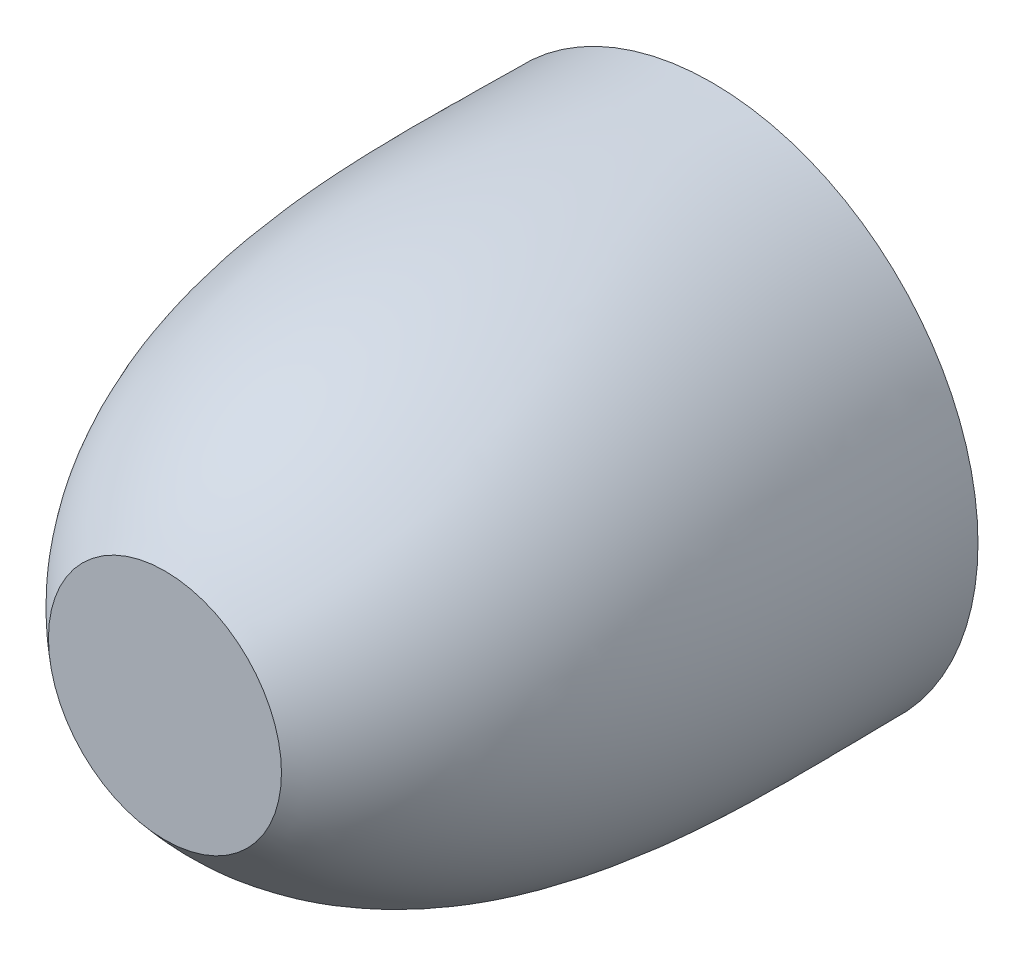
ISO-10303-21;
HEADER;
FILE_DESCRIPTION(('STEP AP214'),'2;1');
FILE_NAME('part.step','',(''),(''),'','','');
FILE_SCHEMA(('AUTOMOTIVE_DESIGN { 1 0 10303 214 1 1 1 1 }'));
ENDSEC;
DATA;
#1=APPLICATION_CONTEXT('core data for automotive mechanical design processes');
#2=APPLICATION_PROTOCOL_DEFINITION('international standard','automotive_design',2000,#1);
#3=PRODUCT_CONTEXT('',#1,'mechanical');
#4=PRODUCT('Part','Part','',(#3));
#5=PRODUCT_RELATED_PRODUCT_CATEGORY('part','',(#4));
#6=PRODUCT_DEFINITION_FORMATION('','',#4);
#7=PRODUCT_DEFINITION_CONTEXT('part definition',#1,'design');
#8=PRODUCT_DEFINITION('design','',#6,#7);
#9=PRODUCT_DEFINITION_SHAPE('','',#8);
#10=(LENGTH_UNIT() NAMED_UNIT(*) SI_UNIT(.MILLI.,.METRE.));
#11=(NAMED_UNIT(*) PLANE_ANGLE_UNIT() SI_UNIT($,.RADIAN.));
#12=(NAMED_UNIT(*) SI_UNIT($,.STERADIAN.) SOLID_ANGLE_UNIT());
#13=UNCERTAINTY_MEASURE_WITH_UNIT(LENGTH_MEASURE(1.E-05),#10,'distance_accuracy_value','');
#14=(GEOMETRIC_REPRESENTATION_CONTEXT(3) GLOBAL_UNCERTAINTY_ASSIGNED_CONTEXT((#13)) GLOBAL_UNIT_ASSIGNED_CONTEXT((#10,
#11,#12)) REPRESENTATION_CONTEXT('',''));
#15=CARTESIAN_POINT('',(0.,0.,0.));
#16=DIRECTION('',(0.,0.,1.));
#17=DIRECTION('',(1.,0.,0.));
#18=AXIS2_PLACEMENT_3D('',#15,#16,#17);
#19=CARTESIAN_POINT('',(-1.61803398875047,1.17557050458536,-43.));
#20=DIRECTION('',(0.809016994374947,-0.587785252292473,0.));
#21=DIRECTION('',(0.587785252292473,0.809016994374947,0.));
#22=AXIS2_PLACEMENT_3D('',#19,#20,#21);
#23=PLANE('',#22);
#24=DIRECTION('',(-0.587785252292473,-0.809016994374947,0.));
#25=VECTOR('',#24,1.);
#26=CARTESIAN_POINT('',(-1.61803398875047,1.17557050458536,-45.));
#27=LINE('',#26,#25);
#28=CARTESIAN_POINT('',(-4.31160439975929,-2.53181111064333,-45.));
#29=VERTEX_POINT('',#28);
#30=CARTESIAN_POINT('',(-14.6433140663486,-16.7521895032941,-45.));
#31=VERTEX_POINT('',#30);
#32=EDGE_CURVE('E257',#29,#31,#27,.T.);
#33=ORIENTED_EDGE('',*,*,#32,.T.);
#34=DIRECTION('',(0.,0.,-1.));
#35=VECTOR('',#34,1.);
#36=CARTESIAN_POINT('',(-14.6433140663486,-16.7521895032941,-43.));
#37=LINE('',#36,#35);
#38=CARTESIAN_POINT('',(-14.6433140663486,-16.7521895032941,-43.));
#39=VERTEX_POINT('',#38);
#40=EDGE_CURVE('E12',#39,#31,#37,.T.);
#41=ORIENTED_EDGE('',*,*,#40,.F.);
#42=DIRECTION('',(-0.587785252292473,-0.809016994374947,0.));
#43=VECTOR('',#42,1.);
#44=CARTESIAN_POINT('',(-1.61803398875047,1.17557050458536,-43.));
#45=LINE('',#44,#43);
#46=CARTESIAN_POINT('',(-4.31160439975929,-2.53181111064333,-43.));
#47=VERTEX_POINT('',#46);
#48=EDGE_CURVE('E220',#47,#39,#45,.T.);
#49=ORIENTED_EDGE('',*,*,#48,.F.);
#50=DIRECTION('',(0.,0.,-1.));
#51=VECTOR('',#50,1.);
#52=CARTESIAN_POINT('',(-4.31160439975929,-2.53181111064333,-43.));
#53=LINE('',#52,#51);
#54=EDGE_CURVE('E48',#47,#29,#53,.T.);
#55=ORIENTED_EDGE('',*,*,#54,.T.);
#56=EDGE_LOOP('',(#33,#41,#49,#55));
#57=FACE_BOUND('',#56,.T.);
#58=ADVANCED_FACE('F45',(#57),#23,.F.);
#59=CARTESIAN_POINT('',(0.,0.,-43.));
#60=DIRECTION('',(0.,0.,-1.));
#61=DIRECTION('',(-1.,0.,0.));
#62=AXIS2_PLACEMENT_3D('',#59,#60,#61);
#63=CYLINDRICAL_SURFACE('',#62,22.25);
#64=CARTESIAN_POINT('',(0.,0.,-45.));
#65=DIRECTION('',(0.,0.,-1.));
#66=DIRECTION('',(-1.,0.,0.));
#67=AXIS2_PLACEMENT_3D('',#64,#65,#66);
#68=CIRCLE('',#67,22.25);
#69=CARTESIAN_POINT('',(-11.4072460888489,-19.1033305124641,-45.));
#70=VERTEX_POINT('',#69);
#71=EDGE_CURVE('E132',#31,#70,#68,.F.);
#72=ORIENTED_EDGE('',*,*,#71,.T.);
#73=DIRECTION('',(0.,0.,-1.));
#74=VECTOR('',#73,1.);
#75=CARTESIAN_POINT('',(-11.4072460888489,-19.1033305124641,-43.));
#76=LINE('',#75,#74);
#77=CARTESIAN_POINT('',(-11.4072460888489,-19.1033305124641,-43.));
#78=VERTEX_POINT('',#77);
#79=EDGE_CURVE('E54',#78,#70,#76,.T.);
#80=ORIENTED_EDGE('',*,*,#79,.F.);
#81=CARTESIAN_POINT('',(0.,0.,-43.));
#82=DIRECTION('',(0.,0.,-1.));
#83=DIRECTION('',(-1.,0.,0.));
#84=AXIS2_PLACEMENT_3D('',#81,#82,#83);
#85=CIRCLE('',#84,22.25);
#86=EDGE_CURVE('E62',#39,#78,#85,.F.);
#87=ORIENTED_EDGE('',*,*,#86,.F.);
#88=ORIENTED_EDGE('',*,*,#40,.T.);
#89=EDGE_LOOP('',(#72,#80,#87,#88));
#90=FACE_BOUND('',#89,.T.);
#91=ADVANCED_FACE('F366',(#90),#63,.T.);
#92=CARTESIAN_POINT('',(1.61803398874932,-1.17557050458453,-43.));
#93=DIRECTION('',(0.809016994374947,-0.587785252292473,0.));
#94=DIRECTION('',(0.587785252292473,0.809016994374947,0.));
#95=AXIS2_PLACEMENT_3D('',#92,#93,#94);
#96=PLANE('',#95);
#97=DIRECTION('',(-0.587785252292473,-0.809016994374947,0.));
#98=VECTOR('',#97,1.);
#99=CARTESIAN_POINT('',(1.61803398874932,-1.17557050458453,-45.));
#100=LINE('',#99,#98);
#101=CARTESIAN_POINT('',(-1.07553642225961,-4.88295211981347,-45.));
#102=VERTEX_POINT('',#101);
#103=EDGE_CURVE('E192',#102,#70,#100,.T.);
#104=ORIENTED_EDGE('',*,*,#103,.F.);
#105=DIRECTION('',(0.,0.,-1.));
#106=VECTOR('',#105,1.);
#107=CARTESIAN_POINT('',(-1.07553642225961,-4.88295211981347,-43.));
#108=LINE('',#107,#106);
#109=CARTESIAN_POINT('',(-1.07553642225961,-4.88295211981347,-43.));
#110=VERTEX_POINT('',#109);
#111=EDGE_CURVE('E188',#110,#102,#108,.T.);
#112=ORIENTED_EDGE('',*,*,#111,.F.);
#113=DIRECTION('',(-0.587785252292473,-0.809016994374947,0.));
#114=VECTOR('',#113,1.);
#115=CARTESIAN_POINT('',(1.61803398874932,-1.17557050458453,-43.));
#116=LINE('',#115,#114);
#117=EDGE_CURVE('E191',#110,#78,#116,.T.);
#118=ORIENTED_EDGE('',*,*,#117,.T.);
#119=ORIENTED_EDGE('',*,*,#79,.T.);
#120=EDGE_LOOP('',(#104,#112,#118,#119));
#121=FACE_BOUND('',#120,.T.);
#122=ADVANCED_FACE('F190',(#121),#96,.T.);
#123=CARTESIAN_POINT('',(0.,0.,-43.));
#124=DIRECTION('',(0.,0.,-1.));
#125=DIRECTION('',(-1.,0.,0.));
#126=AXIS2_PLACEMENT_3D('',#123,#124,#125);
#127=CYLINDRICAL_SURFACE('',#126,5.);
#128=CARTESIAN_POINT('',(0.,0.,-45.));
#129=DIRECTION('',(0.,0.,-1.));
#130=DIRECTION('',(-1.,0.,0.));
#131=AXIS2_PLACEMENT_3D('',#128,#129,#130);
#132=CIRCLE('',#131,5.);
#133=CARTESIAN_POINT('',(1.0755364222584,-4.8829521198138,-45.));
#134=VERTEX_POINT('',#133);
#135=EDGE_CURVE('E264',#134,#102,#132,.T.);
#136=ORIENTED_EDGE('',*,*,#135,.F.);
#137=DIRECTION('',(0.,0.,-1.));
#138=VECTOR('',#137,1.);
#139=CARTESIAN_POINT('',(1.0755364222584,-4.8829521198138,-43.));
#140=LINE('',#139,#138);
#141=CARTESIAN_POINT('',(1.0755364222584,-4.8829521198138,-43.));
#142=VERTEX_POINT('',#141);
#143=EDGE_CURVE('E197',#142,#134,#140,.T.);
#144=ORIENTED_EDGE('',*,*,#143,.F.);
#145=CARTESIAN_POINT('',(0.,0.,-43.));
#146=DIRECTION('',(0.,0.,-1.));
#147=DIRECTION('',(-1.,0.,0.));
#148=AXIS2_PLACEMENT_3D('',#145,#146,#147);
#149=CIRCLE('',#148,5.);
#150=EDGE_CURVE('E203',#142,#110,#149,.T.);
#151=ORIENTED_EDGE('',*,*,#150,.T.);
#152=ORIENTED_EDGE('',*,*,#111,.T.);
#153=EDGE_LOOP('',(#136,#144,#151,#152));
#154=FACE_BOUND('',#153,.T.);
#155=ADVANCED_FACE('F205',(#154),#127,.T.);
#156=CARTESIAN_POINT('',(-1.61803398875028,-1.17557050458523,-43.));
#157=DIRECTION('',(0.809016994374948,0.587785252292473,0.));
#158=DIRECTION('',(-0.587785252292473,0.809016994374948,0.));
#159=AXIS2_PLACEMENT_3D('',#156,#157,#158);
#160=PLANE('',#159);
#161=DIRECTION('',(0.587785252292473,-0.809016994374948,0.));
#162=VECTOR('',#161,1.);
#163=CARTESIAN_POINT('',(-1.61803398875028,-1.17557050458523,-45.));
#164=LINE('',#163,#162);
#165=CARTESIAN_POINT('',(11.4072460888479,-19.1033305124647,-45.));
#166=VERTEX_POINT('',#165);
#167=EDGE_CURVE('E297',#134,#166,#164,.T.);
#168=ORIENTED_EDGE('',*,*,#167,.T.);
#169=DIRECTION('',(0.,0.,-1.));
#170=VECTOR('',#169,1.);
#171=CARTESIAN_POINT('',(11.4072460888479,-19.1033305124647,-43.));
#172=LINE('',#171,#170);
#173=CARTESIAN_POINT('',(11.4072460888479,-19.1033305124647,-43.));
#174=VERTEX_POINT('',#173);
#175=EDGE_CURVE('E305',#174,#166,#172,.T.);
#176=ORIENTED_EDGE('',*,*,#175,.F.);
#177=DIRECTION('',(0.587785252292473,-0.809016994374948,0.));
#178=VECTOR('',#177,1.);
#179=CARTESIAN_POINT('',(-1.61803398875028,-1.17557050458523,-43.));
#180=LINE('',#179,#178);
#181=EDGE_CURVE('E207',#142,#174,#180,.T.);
#182=ORIENTED_EDGE('',*,*,#181,.F.);
#183=ORIENTED_EDGE('',*,*,#143,.T.);
#184=EDGE_LOOP('',(#168,#176,#182,#183));
#185=FACE_BOUND('',#184,.T.);
#186=ADVANCED_FACE('F363',(#185),#160,.F.);
#187=CARTESIAN_POINT('',(0.,0.,-43.));
#188=DIRECTION('',(0.,0.,-1.));
#189=DIRECTION('',(-1.,0.,0.));
#190=AXIS2_PLACEMENT_3D('',#187,#188,#189);
#191=CYLINDRICAL_SURFACE('',#190,22.25);
#192=CARTESIAN_POINT('',(0.,0.,-45.));
#193=DIRECTION('',(0.,0.,-1.));
#194=DIRECTION('',(-1.,0.,0.));
#195=AXIS2_PLACEMENT_3D('',#192,#193,#194);
#196=CIRCLE('',#195,22.25);
#197=CARTESIAN_POINT('',(14.6433140663477,-16.7521895032949,-45.));
#198=VERTEX_POINT('',#197);
#199=EDGE_CURVE('E294',#166,#198,#196,.F.);
#200=ORIENTED_EDGE('',*,*,#199,.T.);
#201=DIRECTION('',(0.,0.,-1.));
#202=VECTOR('',#201,1.);
#203=CARTESIAN_POINT('',(14.6433140663477,-16.7521895032949,-43.));
#204=LINE('',#203,#202);
#205=CARTESIAN_POINT('',(14.6433140663477,-16.7521895032949,-43.));
#206=VERTEX_POINT('',#205);
#207=EDGE_CURVE('E308',#206,#198,#204,.T.);
#208=ORIENTED_EDGE('',*,*,#207,.F.);
#209=CARTESIAN_POINT('',(0.,0.,-43.));
#210=DIRECTION('',(0.,0.,-1.));
#211=DIRECTION('',(-1.,0.,0.));
#212=AXIS2_PLACEMENT_3D('',#209,#210,#211);
#213=CIRCLE('',#212,22.25);
#214=EDGE_CURVE('E211',#174,#206,#213,.F.);
#215=ORIENTED_EDGE('',*,*,#214,.F.);
#216=ORIENTED_EDGE('',*,*,#175,.T.);
#217=EDGE_LOOP('',(#200,#208,#215,#216));
#218=FACE_BOUND('',#217,.T.);
#219=ADVANCED_FACE('F544',(#218),#191,.T.);
#220=CARTESIAN_POINT('',(1.6180339887495,1.17557050458466,-43.));
#221=DIRECTION('',(0.809016994374948,0.587785252292473,0.));
#222=DIRECTION('',(-0.587785252292473,0.809016994374948,0.));
#223=AXIS2_PLACEMENT_3D('',#220,#221,#222);
#224=PLANE('',#223);
#225=DIRECTION('',(0.587785252292473,-0.809016994374948,0.));
#226=VECTOR('',#225,1.);
#227=CARTESIAN_POINT('',(1.6180339887495,1.17557050458466,-45.));
#228=LINE('',#227,#226);
#229=CARTESIAN_POINT('',(4.31160439975846,-2.53181111064393,-45.));
#230=VERTEX_POINT('',#229);
#231=EDGE_CURVE('E291',#230,#198,#228,.T.);
#232=ORIENTED_EDGE('',*,*,#231,.F.);
#233=DIRECTION('',(0.,0.,-1.));
#234=VECTOR('',#233,1.);
#235=CARTESIAN_POINT('',(4.31160439975846,-2.53181111064393,-43.));
#236=LINE('',#235,#234);
#237=CARTESIAN_POINT('',(4.31160439975846,-2.53181111064393,-43.));
#238=VERTEX_POINT('',#237);
#239=EDGE_CURVE('E310',#238,#230,#236,.T.);
#240=ORIENTED_EDGE('',*,*,#239,.F.);
#241=DIRECTION('',(0.587785252292473,-0.809016994374948,0.));
#242=VECTOR('',#241,1.);
#243=CARTESIAN_POINT('',(1.6180339887495,1.17557050458466,-43.));
#244=LINE('',#243,#242);
#245=EDGE_CURVE('E216',#238,#206,#244,.T.);
#246=ORIENTED_EDGE('',*,*,#245,.T.);
#247=ORIENTED_EDGE('',*,*,#207,.T.);
#248=EDGE_LOOP('',(#232,#240,#246,#247));
#249=FACE_BOUND('',#248,.T.);
#250=ADVANCED_FACE('F535',(#249),#224,.T.);
#251=CARTESIAN_POINT('',(4.97632246485322,-0.486019264839568,-45.));
#252=VERTEX_POINT('',#251);
#253=EDGE_CURVE('E290',#252,#230,#132,.T.);
#254=ORIENTED_EDGE('',*,*,#253,.F.);
#255=DIRECTION('',(0.,0.,-1.));
#256=VECTOR('',#255,1.);
#257=CARTESIAN_POINT('',(4.97632246485322,-0.486019264839568,-43.));
#258=LINE('',#257,#256);
#259=CARTESIAN_POINT('',(4.97632246485322,-0.486019264839568,-43.));
#260=VERTEX_POINT('',#259);
#261=EDGE_CURVE('E312',#260,#252,#258,.T.);
#262=ORIENTED_EDGE('',*,*,#261,.F.);
#263=EDGE_CURVE('E209',#260,#238,#149,.T.);
#264=ORIENTED_EDGE('',*,*,#263,.T.);
#265=ORIENTED_EDGE('',*,*,#239,.T.);
#266=EDGE_LOOP('',(#254,#262,#264,#265));
#267=FACE_BOUND('',#266,.T.);
#268=ADVANCED_FACE('F364',(#267),#127,.T.);
#269=CARTESIAN_POINT('',(0.618033988749908,-1.90211303259035,-43.));
#270=DIRECTION('',(-0.309016994374947,0.951056516295154,0.));
#271=DIRECTION('',(-0.951056516295154,-0.309016994374947,0.));
#272=AXIS2_PLACEMENT_3D('',#269,#270,#271);
#273=PLANE('',#272);
#274=DIRECTION('',(0.951056516295154,0.309016994374947,0.));
#275=VECTOR('',#274,1.);
#276=CARTESIAN_POINT('',(0.618033988749908,-1.90211303259035,-45.));
#277=LINE('',#276,#275);
#278=CARTESIAN_POINT('',(21.6933798672906,4.94568194826853,-45.));
#279=VERTEX_POINT('',#278);
#280=EDGE_CURVE('E288',#252,#279,#277,.T.);
#281=ORIENTED_EDGE('',*,*,#280,.T.);
#282=DIRECTION('',(0.,0.,-1.));
#283=VECTOR('',#282,1.);
#284=CARTESIAN_POINT('',(21.6933798672906,4.94568194826853,-43.));
#285=LINE('',#284,#283);
#286=CARTESIAN_POINT('',(21.6933798672906,4.94568194826853,-43.));
#287=VERTEX_POINT('',#286);
#288=EDGE_CURVE('E314',#287,#279,#285,.T.);
#289=ORIENTED_EDGE('',*,*,#288,.F.);
#290=DIRECTION('',(0.951056516295154,0.309016994374947,0.));
#291=VECTOR('',#290,1.);
#292=CARTESIAN_POINT('',(0.618033988749908,-1.90211303259035,-43.));
#293=LINE('',#292,#291);
#294=EDGE_CURVE('E217',#260,#287,#293,.T.);
#295=ORIENTED_EDGE('',*,*,#294,.F.);
#296=ORIENTED_EDGE('',*,*,#261,.T.);
#297=EDGE_LOOP('',(#281,#289,#295,#296));
#298=FACE_BOUND('',#297,.T.);
#299=ADVANCED_FACE('F515',(#298),#273,.F.);
#300=CARTESIAN_POINT('',(0.,0.,-43.));
#301=DIRECTION('',(0.,0.,-1.));
#302=DIRECTION('',(-1.,0.,0.));
#303=AXIS2_PLACEMENT_3D('',#300,#301,#302);
#304=CYLINDRICAL_SURFACE('',#303,22.25);
#305=CARTESIAN_POINT('',(0.,0.,-45.));
#306=DIRECTION('',(0.,0.,-1.));
#307=DIRECTION('',(-1.,0.,0.));
#308=AXIS2_PLACEMENT_3D('',#305,#306,#307);
#309=CIRCLE('',#308,22.25);
#310=CARTESIAN_POINT('',(20.4573118897909,8.74990801344915,-45.));
#311=VERTEX_POINT('',#310);
#312=EDGE_CURVE('E285',#279,#311,#309,.F.);
#313=ORIENTED_EDGE('',*,*,#312,.T.);
#314=DIRECTION('',(0.,0.,-1.));
#315=VECTOR('',#314,1.);
#316=CARTESIAN_POINT('',(20.4573118897909,8.74990801344915,-43.));
#317=LINE('',#316,#315);
#318=CARTESIAN_POINT('',(20.4573118897909,8.74990801344915,-43.));
#319=VERTEX_POINT('',#318);
#320=EDGE_CURVE('E317',#319,#311,#317,.T.);
#321=ORIENTED_EDGE('',*,*,#320,.F.);
#322=CARTESIAN_POINT('',(0.,0.,-43.));
#323=DIRECTION('',(0.,0.,-1.));
#324=DIRECTION('',(-1.,0.,0.));
#325=AXIS2_PLACEMENT_3D('',#322,#323,#324);
#326=CIRCLE('',#325,22.25);
#327=EDGE_CURVE('E241',#287,#319,#326,.F.);
#328=ORIENTED_EDGE('',*,*,#327,.F.);
#329=ORIENTED_EDGE('',*,*,#288,.T.);
#330=EDGE_LOOP('',(#313,#321,#328,#329));
#331=FACE_BOUND('',#330,.T.);
#332=ADVANCED_FACE('F505',(#331),#304,.T.);
#333=CARTESIAN_POINT('',(-0.618033988749881,1.90211303259027,-43.));
#334=DIRECTION('',(-0.309016994374947,0.951056516295154,0.));
#335=DIRECTION('',(-0.951056516295154,-0.309016994374947,0.));
#336=AXIS2_PLACEMENT_3D('',#333,#334,#335);
#337=PLANE('',#336);
#338=DIRECTION('',(0.951056516295154,0.309016994374947,0.));
#339=VECTOR('',#338,1.);
#340=CARTESIAN_POINT('',(-0.618033988749881,1.90211303259027,-45.));
#341=LINE('',#340,#339);
#342=CARTESIAN_POINT('',(3.7402544873534,3.31820680034121,-45.));
#343=VERTEX_POINT('',#342);
#344=EDGE_CURVE('E282',#343,#311,#341,.T.);
#345=ORIENTED_EDGE('',*,*,#344,.F.);
#346=DIRECTION('',(0.,0.,-1.));
#347=VECTOR('',#346,1.);
#348=CARTESIAN_POINT('',(3.7402544873534,3.31820680034121,-43.));
#349=LINE('',#348,#347);
#350=CARTESIAN_POINT('',(3.7402544873534,3.31820680034121,-43.));
#351=VERTEX_POINT('',#350);
#352=EDGE_CURVE('E319',#351,#343,#349,.T.);
#353=ORIENTED_EDGE('',*,*,#352,.F.);
#354=DIRECTION('',(0.951056516295154,0.309016994374947,0.));
#355=VECTOR('',#354,1.);
#356=CARTESIAN_POINT('',(-0.618033988749881,1.90211303259027,-43.));
#357=LINE('',#356,#355);
#358=EDGE_CURVE('E236',#351,#319,#357,.T.);
#359=ORIENTED_EDGE('',*,*,#358,.T.);
#360=ORIENTED_EDGE('',*,*,#320,.T.);
#361=EDGE_LOOP('',(#345,#353,#359,#360));
#362=FACE_BOUND('',#361,.T.);
#363=ADVANCED_FACE('F497',(#362),#337,.T.);
#364=CARTESIAN_POINT('',(2.,4.58257569495584,-45.));
#365=VERTEX_POINT('',#364);
#366=EDGE_CURVE('E281',#365,#343,#132,.T.);
#367=ORIENTED_EDGE('',*,*,#366,.F.);
#368=DIRECTION('',(0.,0.,-1.));
#369=VECTOR('',#368,1.);
#370=CARTESIAN_POINT('',(2.,4.58257569495584,-43.));
#371=LINE('',#370,#369);
#372=CARTESIAN_POINT('',(2.,4.58257569495584,-43.));
#373=VERTEX_POINT('',#372);
#374=EDGE_CURVE('E321',#373,#365,#371,.T.);
#375=ORIENTED_EDGE('',*,*,#374,.F.);
#376=EDGE_CURVE('E218',#373,#351,#149,.T.);
#377=ORIENTED_EDGE('',*,*,#376,.T.);
#378=ORIENTED_EDGE('',*,*,#352,.T.);
#379=EDGE_LOOP('',(#367,#375,#377,#378));
#380=FACE_BOUND('',#379,.T.);
#381=ADVANCED_FACE('F361',(#380),#127,.T.);
#382=CARTESIAN_POINT('',(2.,0.,-43.));
#383=DIRECTION('',(-1.,0.,0.));
#384=DIRECTION('',(0.,0.,1.));
#385=AXIS2_PLACEMENT_3D('',#382,#383,#384);
#386=PLANE('',#385);
#387=DIRECTION('',(0.,1.,0.));
#388=VECTOR('',#387,1.);
#389=CARTESIAN_POINT('',(2.,0.,-45.));
#390=LINE('',#389,#388);
#391=CARTESIAN_POINT('',(2.,22.1599300540412,-45.));
#392=VERTEX_POINT('',#391);
#393=EDGE_CURVE('E279',#365,#392,#390,.T.);
#394=ORIENTED_EDGE('',*,*,#393,.T.);
#395=DIRECTION('',(0.,0.,-1.));
#396=VECTOR('',#395,1.);
#397=CARTESIAN_POINT('',(2.,22.1599300540412,-43.));
#398=LINE('',#397,#396);
#399=CARTESIAN_POINT('',(2.,22.1599300540412,-43.));
#400=VERTEX_POINT('',#399);
#401=EDGE_CURVE('E323',#400,#392,#398,.T.);
#402=ORIENTED_EDGE('',*,*,#401,.F.);
#403=DIRECTION('',(0.,1.,0.));
#404=VECTOR('',#403,1.);
#405=CARTESIAN_POINT('',(2.,0.,-43.));
#406=LINE('',#405,#404);
#407=EDGE_CURVE('E237',#373,#400,#406,.T.);
#408=ORIENTED_EDGE('',*,*,#407,.F.);
#409=ORIENTED_EDGE('',*,*,#374,.T.);
#410=EDGE_LOOP('',(#394,#402,#408,#409));
#411=FACE_BOUND('',#410,.T.);
#412=ADVANCED_FACE('F477',(#411),#386,.F.);
#413=CARTESIAN_POINT('',(0.,0.,-43.));
#414=DIRECTION('',(0.,0.,-1.));
#415=DIRECTION('',(-1.,0.,0.));
#416=AXIS2_PLACEMENT_3D('',#413,#414,#415);
#417=CYLINDRICAL_SURFACE('',#416,22.25);
#418=CARTESIAN_POINT('',(0.,0.,-45.));
#419=DIRECTION('',(0.,0.,-1.));
#420=DIRECTION('',(-1.,0.,0.));
#421=AXIS2_PLACEMENT_3D('',#418,#419,#420);
#422=CIRCLE('',#421,22.25);
#423=CARTESIAN_POINT('',(-2.,22.1599300540412,-45.));
#424=VERTEX_POINT('',#423);
#425=EDGE_CURVE('E276',#392,#424,#422,.F.);
#426=ORIENTED_EDGE('',*,*,#425,.T.);
#427=DIRECTION('',(0.,0.,-1.));
#428=VECTOR('',#427,1.);
#429=CARTESIAN_POINT('',(-2.,22.1599300540412,-43.));
#430=LINE('',#429,#428);
#431=CARTESIAN_POINT('',(-2.,22.1599300540412,-43.));
#432=VERTEX_POINT('',#431);
#433=EDGE_CURVE('E326',#432,#424,#430,.T.);
#434=ORIENTED_EDGE('',*,*,#433,.F.);
#435=CARTESIAN_POINT('',(0.,0.,-43.));
#436=DIRECTION('',(0.,0.,-1.));
#437=DIRECTION('',(-1.,0.,0.));
#438=AXIS2_PLACEMENT_3D('',#435,#436,#437);
#439=CIRCLE('',#438,22.25);
#440=EDGE_CURVE('E232',#400,#432,#439,.F.);
#441=ORIENTED_EDGE('',*,*,#440,.F.);
#442=ORIENTED_EDGE('',*,*,#401,.T.);
#443=EDGE_LOOP('',(#426,#434,#441,#442));
#444=FACE_BOUND('',#443,.T.);
#445=ADVANCED_FACE('F467',(#444),#417,.T.);
#446=CARTESIAN_POINT('',(-2.,0.,-43.));
#447=DIRECTION('',(-1.,0.,0.));
#448=DIRECTION('',(0.,0.,1.));
#449=AXIS2_PLACEMENT_3D('',#446,#447,#448);
#450=PLANE('',#449);
#451=DIRECTION('',(0.,1.,0.));
#452=VECTOR('',#451,1.);
#453=CARTESIAN_POINT('',(-2.,0.,-45.));
#454=LINE('',#453,#452);
#455=CARTESIAN_POINT('',(-2.,4.58257569495584,-45.));
#456=VERTEX_POINT('',#455);
#457=EDGE_CURVE('E273',#456,#424,#454,.T.);
#458=ORIENTED_EDGE('',*,*,#457,.F.);
#459=DIRECTION('',(0.,0.,-1.));
#460=VECTOR('',#459,1.);
#461=CARTESIAN_POINT('',(-2.,4.58257569495584,-43.));
#462=LINE('',#461,#460);
#463=CARTESIAN_POINT('',(-2.,4.58257569495584,-43.));
#464=VERTEX_POINT('',#463);
#465=EDGE_CURVE('E328',#464,#456,#462,.T.);
#466=ORIENTED_EDGE('',*,*,#465,.F.);
#467=DIRECTION('',(0.,1.,0.));
#468=VECTOR('',#467,1.);
#469=CARTESIAN_POINT('',(-2.,0.,-43.));
#470=LINE('',#469,#468);
#471=EDGE_CURVE('E227',#464,#432,#470,.T.);
#472=ORIENTED_EDGE('',*,*,#471,.T.);
#473=ORIENTED_EDGE('',*,*,#433,.T.);
#474=EDGE_LOOP('',(#458,#466,#472,#473));
#475=FACE_BOUND('',#474,.T.);
#476=ADVANCED_FACE('F360',(#475),#450,.T.);
#477=CARTESIAN_POINT('',(-3.74025448735357,3.31820680034159,-45.));
#478=VERTEX_POINT('',#477);
#479=EDGE_CURVE('E265',#478,#456,#132,.T.);
#480=ORIENTED_EDGE('',*,*,#479,.F.);
#481=DIRECTION('',(0.,0.,-1.));
#482=VECTOR('',#481,1.);
#483=CARTESIAN_POINT('',(-3.74025448735357,3.31820680034159,-43.));
#484=LINE('',#483,#482);
#485=CARTESIAN_POINT('',(-3.74025448735357,3.31820680034159,-43.));
#486=VERTEX_POINT('',#485);
#487=EDGE_CURVE('E330',#486,#478,#484,.T.);
#488=ORIENTED_EDGE('',*,*,#487,.F.);
#489=EDGE_CURVE('E221',#486,#464,#149,.T.);
#490=ORIENTED_EDGE('',*,*,#489,.T.);
#491=ORIENTED_EDGE('',*,*,#465,.T.);
#492=EDGE_LOOP('',(#480,#488,#490,#491));
#493=FACE_BOUND('',#492,.T.);
#494=ADVANCED_FACE('F347',(#493),#127,.T.);
#495=CARTESIAN_POINT('',(0.618033988750022,1.9021130325907,-43.));
#496=DIRECTION('',(-0.309016994374948,-0.951056516295154,0.));
#497=DIRECTION('',(0.951056516295154,-0.309016994374948,0.));
#498=AXIS2_PLACEMENT_3D('',#495,#496,#497);
#499=PLANE('',#498);
#500=DIRECTION('',(-0.951056516295154,0.309016994374948,0.));
#501=VECTOR('',#500,1.);
#502=CARTESIAN_POINT('',(0.618033988750022,1.9021130325907,-45.));
#503=LINE('',#502,#501);
#504=CARTESIAN_POINT('',(-20.4573118897907,8.74990801344958,-45.));
#505=VERTEX_POINT('',#504);
#506=EDGE_CURVE('E271',#478,#505,#503,.T.);
#507=ORIENTED_EDGE('',*,*,#506,.T.);
#508=DIRECTION('',(0.,0.,-1.));
#509=VECTOR('',#508,1.);
#510=CARTESIAN_POINT('',(-20.4573118897907,8.74990801344958,-43.));
#511=LINE('',#510,#509);
#512=CARTESIAN_POINT('',(-20.4573118897907,8.74990801344958,-43.));
#513=VERTEX_POINT('',#512);
#514=EDGE_CURVE('E332',#513,#505,#511,.T.);
#515=ORIENTED_EDGE('',*,*,#514,.F.);
#516=DIRECTION('',(-0.951056516295154,0.309016994374948,0.));
#517=VECTOR('',#516,1.);
#518=CARTESIAN_POINT('',(0.618033988750022,1.9021130325907,-43.));
#519=LINE('',#518,#517);
#520=EDGE_CURVE('E228',#486,#513,#519,.T.);
#521=ORIENTED_EDGE('',*,*,#520,.F.);
#522=ORIENTED_EDGE('',*,*,#487,.T.);
#523=EDGE_LOOP('',(#507,#515,#521,#522));
#524=FACE_BOUND('',#523,.T.);
#525=ADVANCED_FACE('F359',(#524),#499,.F.);
#526=CARTESIAN_POINT('',(0.,0.,-43.));
#527=DIRECTION('',(0.,0.,-1.));
#528=DIRECTION('',(-1.,0.,0.));
#529=AXIS2_PLACEMENT_3D('',#526,#527,#528);
#530=CYLINDRICAL_SURFACE('',#529,22.25);
#531=CARTESIAN_POINT('',(0.,0.,-45.));
#532=DIRECTION('',(0.,0.,-1.));
#533=DIRECTION('',(-1.,0.,0.));
#534=AXIS2_PLACEMENT_3D('',#531,#532,#533);
#535=CIRCLE('',#534,22.25);
#536=CARTESIAN_POINT('',(-21.6933798672905,4.94568194826899,-45.));
#537=VERTEX_POINT('',#536);
#538=EDGE_CURVE('E268',#505,#537,#535,.F.);
#539=ORIENTED_EDGE('',*,*,#538,.T.);
#540=DIRECTION('',(0.,0.,-1.));
#541=VECTOR('',#540,1.);
#542=CARTESIAN_POINT('',(-21.6933798672905,4.94568194826899,-43.));
#543=LINE('',#542,#541);
#544=CARTESIAN_POINT('',(-21.6933798672905,4.94568194826899,-43.));
#545=VERTEX_POINT('',#544);
#546=EDGE_CURVE('E335',#545,#537,#543,.T.);
#547=ORIENTED_EDGE('',*,*,#546,.F.);
#548=CARTESIAN_POINT('',(0.,0.,-43.));
#549=DIRECTION('',(0.,0.,-1.));
#550=DIRECTION('',(-1.,0.,0.));
#551=AXIS2_PLACEMENT_3D('',#548,#549,#550);
#552=CIRCLE('',#551,22.25);
#553=EDGE_CURVE('E224',#513,#545,#552,.F.);
#554=ORIENTED_EDGE('',*,*,#553,.F.);
#555=ORIENTED_EDGE('',*,*,#514,.T.);
#556=EDGE_LOOP('',(#539,#547,#554,#555));
#557=FACE_BOUND('',#556,.T.);
#558=ADVANCED_FACE('F354',(#557),#530,.T.);
#559=CARTESIAN_POINT('',(-0.618033988749768,-1.90211303258992,-43.));
#560=DIRECTION('',(-0.309016994374948,-0.951056516295154,0.));
#561=DIRECTION('',(0.951056516295154,-0.309016994374948,0.));
#562=AXIS2_PLACEMENT_3D('',#559,#560,#561);
#563=PLANE('',#562);
#564=DIRECTION('',(-0.951056516295154,0.309016994374948,0.));
#565=VECTOR('',#564,1.);
#566=CARTESIAN_POINT('',(-0.618033988749768,-1.90211303258992,-45.));
#567=LINE('',#566,#565);
#568=CARTESIAN_POINT('',(-4.97632246485348,-0.48601926483892,-45.));
#569=VERTEX_POINT('',#568);
#570=EDGE_CURVE('E263',#569,#537,#567,.T.);
#571=ORIENTED_EDGE('',*,*,#570,.F.);
#572=DIRECTION('',(0.,0.,-1.));
#573=VECTOR('',#572,1.);
#574=CARTESIAN_POINT('',(-4.97632246485348,-0.48601926483892,-43.));
#575=LINE('',#574,#573);
#576=CARTESIAN_POINT('',(-4.97632246485348,-0.48601926483892,-43.));
#577=VERTEX_POINT('',#576);
#578=EDGE_CURVE('E336',#577,#569,#575,.T.);
#579=ORIENTED_EDGE('',*,*,#578,.F.);
#580=DIRECTION('',(-0.951056516295154,0.309016994374948,0.));
#581=VECTOR('',#580,1.);
#582=CARTESIAN_POINT('',(-0.618033988749768,-1.90211303258992,-43.));
#583=LINE('',#582,#581);
#584=EDGE_CURVE('E219',#577,#545,#583,.T.);
#585=ORIENTED_EDGE('',*,*,#584,.T.);
#586=ORIENTED_EDGE('',*,*,#546,.T.);
#587=EDGE_LOOP('',(#571,#579,#585,#586));
#588=FACE_BOUND('',#587,.T.);
#589=ADVANCED_FACE('F345',(#588),#563,.T.);
#590=EDGE_CURVE('E260',#29,#569,#132,.T.);
#591=ORIENTED_EDGE('',*,*,#590,.F.);
#592=ORIENTED_EDGE('',*,*,#54,.F.);
#593=EDGE_CURVE('E210',#47,#577,#149,.T.);
#594=ORIENTED_EDGE('',*,*,#593,.T.);
#595=ORIENTED_EDGE('',*,*,#578,.T.);
#596=EDGE_LOOP('',(#591,#592,#594,#595));
#597=FACE_BOUND('',#596,.T.);
#598=ADVANCED_FACE('F342',(#597),#127,.T.);
#599=CARTESIAN_POINT('',(0.,0.,-43.));
#600=DIRECTION('',(0.,0.,-1.));
#601=DIRECTION('',(-1.,0.,0.));
#602=AXIS2_PLACEMENT_3D('',#599,#600,#601);
#603=CYLINDRICAL_SURFACE('',#602,1.5);
#604=CARTESIAN_POINT('',(0.,0.,-43.));
#605=DIRECTION('',(0.,0.,-1.));
#606=DIRECTION('',(-1.,0.,0.));
#607=AXIS2_PLACEMENT_3D('',#604,#605,#606);
#608=CIRCLE('',#607,1.5);
#609=CARTESIAN_POINT('',(-1.5,0.,-43.));
#610=VERTEX_POINT('',#609);
#611=EDGE_CURVE('E254',#610,#610,#608,.T.);
#612=ORIENTED_EDGE('',*,*,#611,.F.);
#613=EDGE_LOOP('',(#612));
#614=FACE_BOUND('',#613,.T.);
#615=CARTESIAN_POINT('',(0.,0.,-45.));
#616=DIRECTION('',(0.,0.,-1.));
#617=DIRECTION('',(-1.,0.,0.));
#618=AXIS2_PLACEMENT_3D('',#615,#616,#617);
#619=CIRCLE('',#618,1.5);
#620=CARTESIAN_POINT('',(-1.5,0.,-45.));
#621=VERTEX_POINT('',#620);
#622=EDGE_CURVE('E225',#621,#621,#619,.T.);
#623=ORIENTED_EDGE('',*,*,#622,.T.);
#624=EDGE_LOOP('',(#623));
#625=FACE_BOUND('',#624,.T.);
#626=ADVANCED_FACE('F344',(#614,#625),#603,.F.);
#627=CARTESIAN_POINT('',(0.,0.,-43.));
#628=DIRECTION('',(0.,0.,-1.));
#629=DIRECTION('',(-1.,0.,0.));
#630=AXIS2_PLACEMENT_3D('',#627,#628,#629);
#631=PLANE('',#630);
#632=ORIENTED_EDGE('',*,*,#48,.T.);
#633=ORIENTED_EDGE('',*,*,#86,.T.);
#634=ORIENTED_EDGE('',*,*,#117,.F.);
#635=ORIENTED_EDGE('',*,*,#150,.F.);
#636=ORIENTED_EDGE('',*,*,#181,.T.);
#637=ORIENTED_EDGE('',*,*,#214,.T.);
#638=ORIENTED_EDGE('',*,*,#245,.F.);
#639=ORIENTED_EDGE('',*,*,#263,.F.);
#640=ORIENTED_EDGE('',*,*,#294,.T.);
#641=ORIENTED_EDGE('',*,*,#327,.T.);
#642=ORIENTED_EDGE('',*,*,#358,.F.);
#643=ORIENTED_EDGE('',*,*,#376,.F.);
#644=ORIENTED_EDGE('',*,*,#407,.T.);
#645=ORIENTED_EDGE('',*,*,#440,.T.);
#646=ORIENTED_EDGE('',*,*,#471,.F.);
#647=ORIENTED_EDGE('',*,*,#489,.F.);
#648=ORIENTED_EDGE('',*,*,#520,.T.);
#649=ORIENTED_EDGE('',*,*,#553,.T.);
#650=ORIENTED_EDGE('',*,*,#584,.F.);
#651=ORIENTED_EDGE('',*,*,#593,.F.);
#652=EDGE_LOOP('',(#632,#633,#634,#635,#636,#637,#638,#639,#640,#641,#642,#643,#644,#645,#646,
#647,#648,#649,#650,#651));
#653=FACE_BOUND('',#652,.T.);
#654=ORIENTED_EDGE('',*,*,#611,.T.);
#655=EDGE_LOOP('',(#654));
#656=FACE_BOUND('',#655,.T.);
#657=ADVANCED_FACE('F201',(#653,#656),#631,.F.);
#658=CARTESIAN_POINT('',(0.,0.,-45.));
#659=DIRECTION('',(0.,0.,-1.));
#660=DIRECTION('',(-1.,0.,0.));
#661=AXIS2_PLACEMENT_3D('',#658,#659,#660);
#662=PLANE('',#661);
#663=ORIENTED_EDGE('',*,*,#32,.F.);
#664=ORIENTED_EDGE('',*,*,#590,.T.);
#665=ORIENTED_EDGE('',*,*,#570,.T.);
#666=ORIENTED_EDGE('',*,*,#538,.F.);
#667=ORIENTED_EDGE('',*,*,#506,.F.);
#668=ORIENTED_EDGE('',*,*,#479,.T.);
#669=ORIENTED_EDGE('',*,*,#457,.T.);
#670=ORIENTED_EDGE('',*,*,#425,.F.);
#671=ORIENTED_EDGE('',*,*,#393,.F.);
#672=ORIENTED_EDGE('',*,*,#366,.T.);
#673=ORIENTED_EDGE('',*,*,#344,.T.);
#674=ORIENTED_EDGE('',*,*,#312,.F.);
#675=ORIENTED_EDGE('',*,*,#280,.F.);
#676=ORIENTED_EDGE('',*,*,#253,.T.);
#677=ORIENTED_EDGE('',*,*,#231,.T.);
#678=ORIENTED_EDGE('',*,*,#199,.F.);
#679=ORIENTED_EDGE('',*,*,#167,.F.);
#680=ORIENTED_EDGE('',*,*,#135,.T.);
#681=ORIENTED_EDGE('',*,*,#103,.T.);
#682=ORIENTED_EDGE('',*,*,#71,.F.);
#683=EDGE_LOOP('',(#663,#664,#665,#666,#667,#668,#669,#670,#671,#672,#673,#674,#675,#676,#677,
#678,#679,#680,#681,#682));
#684=FACE_BOUND('',#683,.T.);
#685=ORIENTED_EDGE('',*,*,#622,.F.);
#686=EDGE_LOOP('',(#685));
#687=FACE_BOUND('',#686,.T.);
#688=ADVANCED_FACE('F340',(#684,#687),#662,.T.);
#689=CLOSED_SHELL('',(#58,#91,#122,#155,#186,#219,#250,#268,#299,#332,#363,#381,#412,#445,#476,
#494,#525,#558,#589,#598,#626,#657,#688));
#690=MANIFOLD_SOLID_BREP('B2',#689);
#691=CARTESIAN_POINT('',(0.,0.,4.));
#692=DIRECTION('',(0.,0.,-1.));
#693=DIRECTION('',(-1.,0.,0.));
#694=AXIS2_PLACEMENT_3D('',#691,#692,#693);
#695=PLANE('',#694);
#696=CARTESIAN_POINT('',(0.,0.,4.));
#697=DIRECTION('',(0.,0.,1.));
#698=DIRECTION('',(1.,0.,0.));
#699=AXIS2_PLACEMENT_3D('',#696,#697,#698);
#700=CIRCLE('',#699,11.5);
#701=CARTESIAN_POINT('',(11.5,0.,4.));
#702=VERTEX_POINT('',#701);
#703=EDGE_CURVE('E44',#702,#702,#700,.T.);
#704=ORIENTED_EDGE('',*,*,#703,.T.);
#705=EDGE_LOOP('',(#704));
#706=FACE_BOUND('',#705,.T.);
#707=ADVANCED_FACE('F639',(#706),#695,.F.);
#708=CARTESIAN_POINT('',(11.5,0.,4.));
#709=CARTESIAN_POINT('',(11.7251733431807,0.,3.80348508231503));
#710=CARTESIAN_POINT('',(12.0674188014692,0.,3.50474973693397));
#711=CARTESIAN_POINT('',(12.5058043051174,0.,3.12228781850695));
#712=CARTESIAN_POINT('',(13.0039957223316,0.,2.68698631536532));
#713=CARTESIAN_POINT('',(13.6310354768457,0.,2.11059948745728));
#714=CARTESIAN_POINT('',(14.586618127734,0.,1.1779068986425));
#715=CARTESIAN_POINT('',(15.718513743632,0.,-0.0322725429137335));
#716=CARTESIAN_POINT('',(17.3880466240341,0.,-2.04442819045492));
#717=CARTESIAN_POINT('',(19.2212821063381,0.,-4.6921664186516));
#718=CARTESIAN_POINT('',(21.6489696922715,0.,-9.14955988827911));
#719=CARTESIAN_POINT('',(23.8235273063837,0.,-15.0335464253074));
#720=CARTESIAN_POINT('',(25.3610550271456,0.,-22.3394892256269));
#721=CARTESIAN_POINT('',(26.1162476446908,0.,-29.6934969559585));
#722=CARTESIAN_POINT('',(26.3117121805276,0.,-35.7067172362428));
#723=CARTESIAN_POINT('',(26.3294835649926,0.,-40.3503715958984));
#724=CARTESIAN_POINT('',(26.30267550729,0.,-43.7249217540455));
#725=CARTESIAN_POINT('',(26.2708344397963,0.,-46.4197651012457));
#726=CARTESIAN_POINT('',(26.2536075456404,0.,-48.5007384819985));
#727=CARTESIAN_POINT('',(26.25,0.,-49.4965179539217));
#728=CARTESIAN_POINT('',(26.25,0.,-50.));
#729=B_SPLINE_CURVE_WITH_KNOTS('',3,(#708,#709,#710,#711,#712,#713,#714,#715,#716,#717,#718,
#719,#720,#721,#722,#723,#724,#725,#726,#727,#728),.UNSPECIFIED.,.F.,.F.,(4,1,1,1,1,1,1,1,1,1,1,
1,1,1,1,1,1,1,4),(-0.0268421038111921,-0.0107976959391422,-0.00277549200311727,
0.00524671193290767,0.0212911198049575,0.0373355276770074,0.0694243434211072,0.101513159165207,
0.165690790653406,0.229868422141606,0.358223685118005,0.486578948094404,0.614934211070803,
0.743289474047202,0.807467105535401,0.871644737023601,0.935822368511801,0.9679111842559,1.),.UNSPECIFIED.);
#730=CARTESIAN_POINT('',(0.,0.,0.));
#731=DIRECTION('',(0.,0.,1.));
#732=AXIS1_PLACEMENT('',#730,#731);
#733=SURFACE_OF_REVOLUTION('',#729,#732);
#734=CARTESIAN_POINT('',(0.,0.,-50.));
#735=DIRECTION('',(0.,0.,1.));
#736=DIRECTION('',(1.,0.,0.));
#737=AXIS2_PLACEMENT_3D('',#734,#735,#736);
#738=CIRCLE('',#737,26.25);
#739=CARTESIAN_POINT('',(26.25,0.,-50.));
#740=VERTEX_POINT('',#739);
#741=EDGE_CURVE('E645',#740,#740,#738,.T.);
#742=ORIENTED_EDGE('',*,*,#741,.T.);
#743=EDGE_LOOP('',(#742));
#744=FACE_BOUND('',#743,.T.);
#745=ORIENTED_EDGE('',*,*,#703,.F.);
#746=EDGE_LOOP('',(#745));
#747=FACE_BOUND('',#746,.T.);
#748=ADVANCED_FACE('F677',(#744,#747),#733,.F.);
#749=CARTESIAN_POINT('',(0.,0.,-50.));
#750=DIRECTION('',(0.,0.,1.));
#751=DIRECTION('',(1.,0.,0.));
#752=AXIS2_PLACEMENT_3D('',#749,#750,#751);
#753=PLANE('',#752);
#754=ORIENTED_EDGE('',*,*,#741,.F.);
#755=EDGE_LOOP('',(#754));
#756=FACE_BOUND('',#755,.T.);
#757=CARTESIAN_POINT('',(0.,0.,-50.));
#758=DIRECTION('',(0.,0.,1.));
#759=DIRECTION('',(1.,0.,0.));
#760=AXIS2_PLACEMENT_3D('',#757,#758,#759);
#761=CIRCLE('',#760,22.25);
#762=CARTESIAN_POINT('',(22.25,0.,-50.));
#763=VERTEX_POINT('',#762);
#764=EDGE_CURVE('E649',#763,#763,#761,.T.);
#765=ORIENTED_EDGE('',*,*,#764,.T.);
#766=EDGE_LOOP('',(#765));
#767=FACE_BOUND('',#766,.T.);
#768=ADVANCED_FACE('F674',(#756,#767),#753,.F.);
#769=CARTESIAN_POINT('',(10.,0.,0.));
#770=CARTESIAN_POINT('',(24.0343816347976,0.,-12.2481876085506));
#771=CARTESIAN_POINT('',(22.25,0.,-34.257055753999));
#772=CARTESIAN_POINT('',(22.25,0.,-50.));
#773=B_SPLINE_CURVE_WITH_KNOTS('',3,(#769,#770,#771,#772),.UNSPECIFIED.,.F.,.F.,(4,4),(0.,1.),.UNSPECIFIED.);
#774=CARTESIAN_POINT('',(0.,0.,0.));
#775=DIRECTION('',(0.,0.,1.));
#776=AXIS1_PLACEMENT('',#774,#775);
#777=SURFACE_OF_REVOLUTION('',#773,#776);
#778=ORIENTED_EDGE('',*,*,#764,.F.);
#779=EDGE_LOOP('',(#778));
#780=FACE_BOUND('',#779,.T.);
#781=CARTESIAN_POINT('',(0.,0.,0.));
#782=DIRECTION('',(0.,0.,1.));
#783=DIRECTION('',(1.,0.,0.));
#784=AXIS2_PLACEMENT_3D('',#781,#782,#783);
#785=CIRCLE('',#784,10.);
#786=CARTESIAN_POINT('',(10.,0.,0.));
#787=VERTEX_POINT('',#786);
#788=EDGE_CURVE('E653',#787,#787,#785,.T.);
#789=ORIENTED_EDGE('',*,*,#788,.T.);
#790=EDGE_LOOP('',(#789));
#791=FACE_BOUND('',#790,.T.);
#792=ADVANCED_FACE('F669',(#780,#791),#777,.T.);
#793=CARTESIAN_POINT('',(0.,0.,0.));
#794=DIRECTION('',(0.,0.,-1.));
#795=DIRECTION('',(-1.,0.,0.));
#796=AXIS2_PLACEMENT_3D('',#793,#794,#795);
#797=PLANE('',#796);
#798=ORIENTED_EDGE('',*,*,#788,.F.);
#799=EDGE_LOOP('',(#798));
#800=FACE_BOUND('',#799,.T.);
#801=ADVANCED_FACE('F673',(#800),#797,.T.);
#802=CLOSED_SHELL('',(#707,#748,#768,#792,#801));
#803=MANIFOLD_SOLID_BREP('B6',#802);
#804=ADVANCED_BREP_SHAPE_REPRESENTATION('',(#18,#690,#803),#14);
#805=SHAPE_DEFINITION_REPRESENTATION(#9,#804);
ENDSEC;
END-ISO-10303-21;
